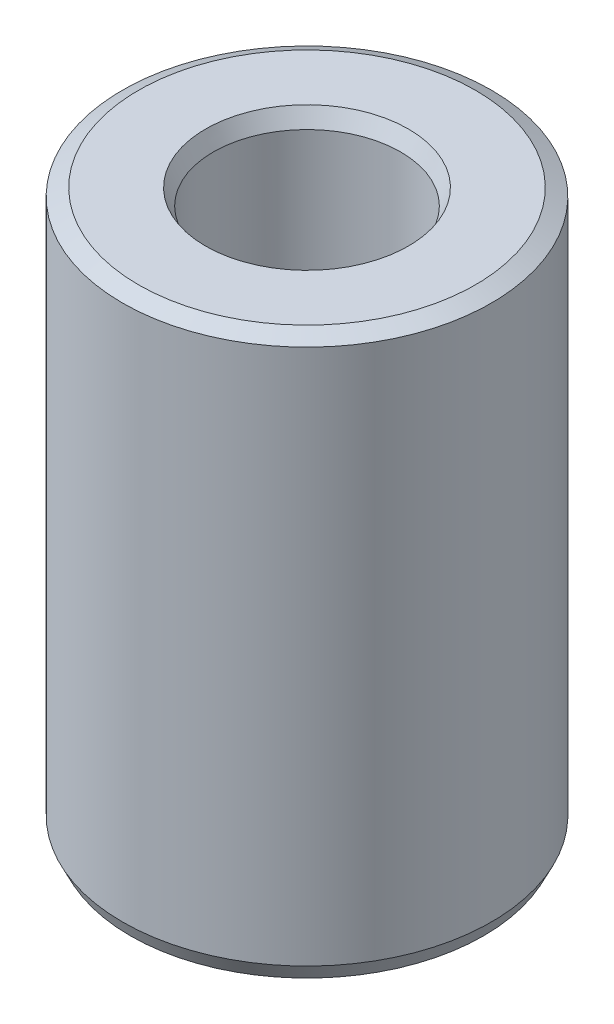
ISO-10303-21;
HEADER;
FILE_DESCRIPTION(('STEP AP214'),'2;1');
FILE_NAME('part.step','',(''),(''),'','','');
FILE_SCHEMA(('AUTOMOTIVE_DESIGN { 1 0 10303 214 1 1 1 1 }'));
ENDSEC;
DATA;
#1=APPLICATION_CONTEXT('core data for automotive mechanical design processes');
#2=APPLICATION_PROTOCOL_DEFINITION('international standard','automotive_design',2000,#1);
#3=PRODUCT_CONTEXT('',#1,'mechanical');
#4=PRODUCT('Part','Part','',(#3));
#5=PRODUCT_RELATED_PRODUCT_CATEGORY('part','',(#4));
#6=PRODUCT_DEFINITION_FORMATION('','',#4);
#7=PRODUCT_DEFINITION_CONTEXT('part definition',#1,'design');
#8=PRODUCT_DEFINITION('design','',#6,#7);
#9=PRODUCT_DEFINITION_SHAPE('','',#8);
#10=(LENGTH_UNIT() NAMED_UNIT(*) SI_UNIT(.MILLI.,.METRE.));
#11=(NAMED_UNIT(*) PLANE_ANGLE_UNIT() SI_UNIT($,.RADIAN.));
#12=(NAMED_UNIT(*) SI_UNIT($,.STERADIAN.) SOLID_ANGLE_UNIT());
#13=UNCERTAINTY_MEASURE_WITH_UNIT(LENGTH_MEASURE(1.E-05),#10,'distance_accuracy_value','');
#14=(GEOMETRIC_REPRESENTATION_CONTEXT(3) GLOBAL_UNCERTAINTY_ASSIGNED_CONTEXT((#13)) GLOBAL_UNIT_ASSIGNED_CONTEXT((#10,
#11,#12)) REPRESENTATION_CONTEXT('',''));
#15=CARTESIAN_POINT('',(0.,0.,0.));
#16=DIRECTION('',(0.,0.,1.));
#17=DIRECTION('',(1.,0.,0.));
#18=AXIS2_PLACEMENT_3D('',#15,#16,#17);
#19=CARTESIAN_POINT('',(0.,75.8702042213604,0.));
#20=DIRECTION('',(0.,-1.,0.));
#21=DIRECTION('',(0.,0.,-1.));
#22=AXIS2_PLACEMENT_3D('',#19,#20,#21);
#23=CYLINDRICAL_SURFACE('',#22,25.);
#24=CARTESIAN_POINT('',(0.,2.16007570095776,0.));
#25=DIRECTION('',(0.,1.,0.));
#26=DIRECTION('',(0.,0.,1.));
#27=AXIS2_PLACEMENT_3D('',#24,#25,#26);
#28=CIRCLE('',#27,25.);
#29=CARTESIAN_POINT('',(0.,2.16007570095775,-25.));
#30=VERTEX_POINT('',#29);
#31=EDGE_CURVE('E10',#30,#30,#28,.T.);
#32=CARTESIAN_POINT('',(0.,74.8098274000161,0.));
#33=DIRECTION('',(0.,1.,0.));
#34=DIRECTION('',(0.,0.,1.));
#35=AXIS2_PLACEMENT_3D('',#32,#33,#34);
#36=CIRCLE('',#35,25.);
#37=CARTESIAN_POINT('',(0.,74.8098274000161,-25.));
#38=VERTEX_POINT('',#37);
#39=EDGE_CURVE('E50',#38,#38,#36,.F.);
#40=CARTESIAN_POINT('',(0.,2.16007570095775,-25.));
#41=CARTESIAN_POINT('',(0.,2.91684394782294,-25.));
#42=CARTESIAN_POINT('',(0.,3.67361219468813,-25.));
#43=CARTESIAN_POINT('',(0.,5.18714868841851,-25.));
#44=CARTESIAN_POINT('',(0.,5.9439169352837,-25.));
#45=CARTESIAN_POINT('',(0.,7.45745342901408,-25.));
#46=CARTESIAN_POINT('',(0.,8.21422167587927,-25.));
#47=CARTESIAN_POINT('',(0.,9.72775816960965,-25.));
#48=CARTESIAN_POINT('',(0.,10.4845264164748,-25.));
#49=CARTESIAN_POINT('',(0.,11.9980629102052,-25.));
#50=CARTESIAN_POINT('',(0.,12.7548311570704,-25.));
#51=CARTESIAN_POINT('',(0.,14.2683676508008,-25.));
#52=CARTESIAN_POINT('',(0.,15.025135897666,-25.));
#53=CARTESIAN_POINT('',(0.,16.5386723913964,-25.));
#54=CARTESIAN_POINT('',(0.,17.2954406382616,-25.));
#55=CARTESIAN_POINT('',(0.,18.8089771319919,-25.));
#56=CARTESIAN_POINT('',(0.,19.5657453788571,-25.));
#57=CARTESIAN_POINT('',(0.,21.0792818725875,-25.));
#58=CARTESIAN_POINT('',(0.,21.8360501194527,-25.));
#59=CARTESIAN_POINT('',(0.,23.3495866131831,-25.));
#60=CARTESIAN_POINT('',(0.,24.1063548600483,-25.));
#61=CARTESIAN_POINT('',(0.,25.6198913537787,-25.));
#62=CARTESIAN_POINT('',(0.,26.3766596006439,-25.));
#63=CARTESIAN_POINT('',(0.,27.8901960943742,-25.));
#64=CARTESIAN_POINT('',(0.,28.6469643412394,-25.));
#65=CARTESIAN_POINT('',(0.,30.1605008349698,-25.));
#66=CARTESIAN_POINT('',(0.,30.917269081835,-25.));
#67=CARTESIAN_POINT('',(0.,32.4308055755654,-25.));
#68=CARTESIAN_POINT('',(0.,33.1875738224306,-25.));
#69=CARTESIAN_POINT('',(0.,34.701110316161,-25.));
#70=CARTESIAN_POINT('',(0.,35.4578785630261,-25.));
#71=CARTESIAN_POINT('',(0.,36.9714150567565,-25.));
#72=CARTESIAN_POINT('',(0.,37.7281833036217,-25.));
#73=CARTESIAN_POINT('',(0.,39.2417197973521,-25.));
#74=CARTESIAN_POINT('',(0.,39.9984880442173,-25.));
#75=CARTESIAN_POINT('',(0.,41.5120245379477,-25.));
#76=CARTESIAN_POINT('',(0.,42.2687927848129,-25.));
#77=CARTESIAN_POINT('',(0.,43.7823292785433,-25.));
#78=CARTESIAN_POINT('',(0.,44.5390975254084,-25.));
#79=CARTESIAN_POINT('',(0.,46.0526340191388,-25.));
#80=CARTESIAN_POINT('',(0.,46.809402266004,-25.));
#81=CARTESIAN_POINT('',(0.,48.3229387597344,-25.));
#82=CARTESIAN_POINT('',(0.,49.0797070065996,-25.));
#83=CARTESIAN_POINT('',(0.,50.59324350033,-25.));
#84=CARTESIAN_POINT('',(0.,51.3500117471952,-25.));
#85=CARTESIAN_POINT('',(0.,52.8635482409255,-25.));
#86=CARTESIAN_POINT('',(0.,53.6203164877907,-25.));
#87=CARTESIAN_POINT('',(0.,55.1338529815211,-25.));
#88=CARTESIAN_POINT('',(0.,55.8906212283863,-25.));
#89=CARTESIAN_POINT('',(0.,57.4041577221167,-25.));
#90=CARTESIAN_POINT('',(0.,58.1609259689819,-25.));
#91=CARTESIAN_POINT('',(0.,59.6744624627123,-25.));
#92=CARTESIAN_POINT('',(0.,60.4312307095774,-25.));
#93=CARTESIAN_POINT('',(0.,61.9447672033078,-25.));
#94=CARTESIAN_POINT('',(0.,62.701535450173,-25.));
#95=CARTESIAN_POINT('',(0.,64.2150719439034,-25.));
#96=CARTESIAN_POINT('',(0.,64.9718401907686,-25.));
#97=CARTESIAN_POINT('',(0.,66.485376684499,-25.));
#98=CARTESIAN_POINT('',(0.,67.2421449313642,-25.));
#99=CARTESIAN_POINT('',(0.,68.7556814250946,-25.));
#100=CARTESIAN_POINT('',(0.,69.5124496719598,-25.));
#101=CARTESIAN_POINT('',(0.,71.0259861656901,-25.));
#102=CARTESIAN_POINT('',(0.,71.7827544125553,-25.));
#103=CARTESIAN_POINT('',(0.,73.2962909062857,-25.));
#104=CARTESIAN_POINT('',(0.,74.0530591531509,-25.));
#105=CARTESIAN_POINT('',(0.,74.8098274000161,-25.));
#106=B_SPLINE_CURVE_WITH_KNOTS('',3,(#40,#41,#42,#43,#44,#45,#46,#47,#48,#49,#50,#51,#52,#53,
#54,#55,#56,#57,#58,#59,#60,#61,#62,#63,#64,#65,#66,#67,#68,#69,#70,#71,#72,#73,#74,#75,#76,#77,
#78,#79,#80,#81,#82,#83,#84,#85,#86,#87,#88,#89,#90,#91,#92,#93,#94,#95,#96,#97,#98,#99,#100,
#101,#102,#103,#104,#105),.UNSPECIFIED.,.F.,.F.,(4,2,2,2,2,2,2,2,2,2,2,2,2,2,2,2,2,2,2,2,2,2,2,
2,2,2,2,2,2,2,2,2,4),(0.,2.27030474059557,4.54060948119114,6.81091422178672,9.08121896238229,
11.3515237029779,13.6218284435734,15.892133184169,18.1624379247646,20.4327426653602,
22.7030474059557,24.9733521465513,27.2436568871469,29.5139616277424,31.784266368338,
34.0545711089336,36.3248758495292,38.5951805901247,40.8654853307203,43.1357900713159,
45.4060948119115,47.676399552507,49.9467042931026,52.2170090336982,54.4873137742938,
56.7576185148893,59.0279232554849,61.2982279960805,63.568532736676,65.8388374772716,
68.1091422178672,70.3794469584628,72.6497516990583),.UNSPECIFIED.);
#107=EDGE_CURVE('BSEAM39',#30,#38,#106,.T.);
#108=ORIENTED_EDGE('',*,*,#31,.T.);
#109=ORIENTED_EDGE('',*,*,#39,.T.);
#110=ORIENTED_EDGE('',*,*,#107,.T.);
#111=ORIENTED_EDGE('',*,*,#107,.F.);
#112=EDGE_LOOP('',(#108,#110,#109,#111));
#113=FACE_BOUND('',#112,.T.);
#114=ADVANCED_FACE('F39',(#113),#23,.T.);
#115=CARTESIAN_POINT('',(0.,75.8702042213604,0.));
#116=DIRECTION('',(0.,1.,0.));
#117=DIRECTION('',(0.,0.,1.));
#118=AXIS2_PLACEMENT_3D('',#115,#116,#117);
#119=PLANE('',#118);
#120=CARTESIAN_POINT('',(0.,75.8702042213604,0.));
#121=DIRECTION('',(0.,1.,0.));
#122=DIRECTION('',(0.,0.,1.));
#123=AXIS2_PLACEMENT_3D('',#120,#121,#122);
#124=CIRCLE('',#123,13.7490943435613);
#125=CARTESIAN_POINT('',(0.,75.8702042213604,13.7490943435613));
#126=VERTEX_POINT('',#125);
#127=EDGE_CURVE('E58',#126,#126,#124,.F.);
#128=ORIENTED_EDGE('',*,*,#127,.T.);
#129=EDGE_LOOP('',(#128));
#130=FACE_BOUND('',#129,.T.);
#131=CARTESIAN_POINT('',(0.,75.8702042213604,0.));
#132=DIRECTION('',(0.,1.,0.));
#133=DIRECTION('',(0.,0.,1.));
#134=AXIS2_PLACEMENT_3D('',#131,#132,#133);
#135=CIRCLE('',#134,22.8399242990425);
#136=CARTESIAN_POINT('',(0.,75.8702042213604,22.8399242990425));
#137=VERTEX_POINT('',#136);
#138=EDGE_CURVE('E61',#137,#137,#135,.T.);
#139=ORIENTED_EDGE('',*,*,#138,.T.);
#140=EDGE_LOOP('',(#139));
#141=FACE_BOUND('',#140,.T.);
#142=ADVANCED_FACE('F88',(#130,#141),#119,.T.);
#143=CARTESIAN_POINT('',(0.,0.,0.));
#144=DIRECTION('',(0.,1.,0.));
#145=DIRECTION('',(0.,0.,1.));
#146=AXIS2_PLACEMENT_3D('',#143,#144,#145);
#147=PLANE('',#146);
#148=CARTESIAN_POINT('',(0.,0.,0.));
#149=DIRECTION('',(0.,1.,0.));
#150=DIRECTION('',(0.,0.,1.));
#151=AXIS2_PLACEMENT_3D('',#148,#149,#150);
#152=CIRCLE('',#151,14.8487932231744);
#153=CARTESIAN_POINT('',(0.,0.,14.8487932231744));
#154=VERTEX_POINT('',#153);
#155=EDGE_CURVE('E51',#154,#154,#152,.T.);
#156=ORIENTED_EDGE('',*,*,#155,.T.);
#157=EDGE_LOOP('',(#156));
#158=FACE_BOUND('',#157,.T.);
#159=CARTESIAN_POINT('',(0.,0.,0.));
#160=DIRECTION('',(0.,1.,0.));
#161=DIRECTION('',(0.,0.,1.));
#162=AXIS2_PLACEMENT_3D('',#159,#160,#161);
#163=CIRCLE('',#162,23.9396231786556);
#164=CARTESIAN_POINT('',(0.,0.,23.9396231786556));
#165=VERTEX_POINT('',#164);
#166=EDGE_CURVE('E54',#165,#165,#163,.F.);
#167=ORIENTED_EDGE('',*,*,#166,.T.);
#168=EDGE_LOOP('',(#167));
#169=FACE_BOUND('',#168,.T.);
#170=ADVANCED_FACE('F83',(#158,#169),#147,.F.);
#171=CARTESIAN_POINT('',(0.,75.8702042213604,0.));
#172=DIRECTION('',(0.,-1.,0.));
#173=DIRECTION('',(0.,0.,-1.));
#174=AXIS2_PLACEMENT_3D('',#171,#172,#173);
#175=CYLINDRICAL_SURFACE('',#174,12.6887175222169);
#176=CARTESIAN_POINT('',(0.,73.7101285204027,0.));
#177=DIRECTION('',(0.,1.,0.));
#178=DIRECTION('',(0.,0.,1.));
#179=AXIS2_PLACEMENT_3D('',#176,#177,#178);
#180=CIRCLE('',#179,12.6887175222169);
#181=CARTESIAN_POINT('',(0.,73.7101285204027,-12.6887175222169));
#182=VERTEX_POINT('',#181);
#183=EDGE_CURVE('E67',#182,#182,#180,.T.);
#184=CARTESIAN_POINT('',(0.,1.0603768213443,0.));
#185=DIRECTION('',(0.,1.,0.));
#186=DIRECTION('',(0.,0.,1.));
#187=AXIS2_PLACEMENT_3D('',#184,#185,#186);
#188=CIRCLE('',#187,12.6887175222169);
#189=CARTESIAN_POINT('',(0.,1.0603768213443,-12.6887175222169));
#190=VERTEX_POINT('',#189);
#191=EDGE_CURVE('E69',#190,#190,#188,.F.);
#192=CARTESIAN_POINT('',(0.,73.7101285204027,-12.6887175222169));
#193=CARTESIAN_POINT('',(0.,72.9533602735375,-12.6887175222169));
#194=CARTESIAN_POINT('',(0.,72.1965920266723,-12.6887175222169));
#195=CARTESIAN_POINT('',(0.,70.6830555329419,-12.6887175222169));
#196=CARTESIAN_POINT('',(0.,69.9262872860767,-12.6887175222169));
#197=CARTESIAN_POINT('',(0.,68.4127507923463,-12.6887175222169));
#198=CARTESIAN_POINT('',(0.,67.6559825454811,-12.6887175222169));
#199=CARTESIAN_POINT('',(0.,66.1424460517508,-12.6887175222169));
#200=CARTESIAN_POINT('',(0.,65.3856778048856,-12.6887175222169));
#201=CARTESIAN_POINT('',(0.,63.8721413111552,-12.6887175222169));
#202=CARTESIAN_POINT('',(0.,63.11537306429,-12.6887175222169));
#203=CARTESIAN_POINT('',(0.,61.6018365705596,-12.6887175222169));
#204=CARTESIAN_POINT('',(0.,60.8450683236944,-12.6887175222169));
#205=CARTESIAN_POINT('',(0.,59.331531829964,-12.6887175222169));
#206=CARTESIAN_POINT('',(0.,58.5747635830989,-12.6887175222169));
#207=CARTESIAN_POINT('',(0.,57.0612270893685,-12.6887175222169));
#208=CARTESIAN_POINT('',(0.,56.3044588425033,-12.6887175222169));
#209=CARTESIAN_POINT('',(0.,54.7909223487729,-12.6887175222169));
#210=CARTESIAN_POINT('',(0.,54.0341541019077,-12.6887175222169));
#211=CARTESIAN_POINT('',(0.,52.5206176081773,-12.6887175222169));
#212=CARTESIAN_POINT('',(0.,51.7638493613121,-12.6887175222169));
#213=CARTESIAN_POINT('',(0.,50.2503128675817,-12.6887175222169));
#214=CARTESIAN_POINT('',(0.,49.4935446207166,-12.6887175222169));
#215=CARTESIAN_POINT('',(0.,47.9800081269862,-12.6887175222169));
#216=CARTESIAN_POINT('',(0.,47.223239880121,-12.6887175222169));
#217=CARTESIAN_POINT('',(0.,45.7097033863906,-12.6887175222169));
#218=CARTESIAN_POINT('',(0.,44.9529351395254,-12.6887175222169));
#219=CARTESIAN_POINT('',(0.,43.439398645795,-12.6887175222169));
#220=CARTESIAN_POINT('',(0.,42.6826303989298,-12.6887175222169));
#221=CARTESIAN_POINT('',(0.,41.1690939051994,-12.6887175222169));
#222=CARTESIAN_POINT('',(0.,40.4123256583343,-12.6887175222169));
#223=CARTESIAN_POINT('',(0.,38.8987891646039,-12.6887175222169));
#224=CARTESIAN_POINT('',(0.,38.1420209177387,-12.6887175222169));
#225=CARTESIAN_POINT('',(0.,36.6284844240083,-12.6887175222169));
#226=CARTESIAN_POINT('',(0.,35.8717161771431,-12.6887175222169));
#227=CARTESIAN_POINT('',(0.,34.3581796834127,-12.6887175222169));
#228=CARTESIAN_POINT('',(0.,33.6014114365475,-12.6887175222169));
#229=CARTESIAN_POINT('',(0.,32.0878749428171,-12.6887175222169));
#230=CARTESIAN_POINT('',(0.,31.331106695952,-12.6887175222169));
#231=CARTESIAN_POINT('',(0.,29.8175702022216,-12.6887175222169));
#232=CARTESIAN_POINT('',(0.,29.0608019553564,-12.6887175222169));
#233=CARTESIAN_POINT('',(0.,27.547265461626,-12.6887175222169));
#234=CARTESIAN_POINT('',(0.,26.7904972147608,-12.6887175222169));
#235=CARTESIAN_POINT('',(0.,25.2769607210304,-12.6887175222169));
#236=CARTESIAN_POINT('',(0.,24.5201924741652,-12.6887175222169));
#237=CARTESIAN_POINT('',(0.,23.0066559804349,-12.6887175222169));
#238=CARTESIAN_POINT('',(0.,22.2498877335697,-12.6887175222169));
#239=CARTESIAN_POINT('',(0.,20.7363512398393,-12.6887175222169));
#240=CARTESIAN_POINT('',(0.,19.9795829929741,-12.6887175222169));
#241=CARTESIAN_POINT('',(0.,18.4660464992437,-12.6887175222169));
#242=CARTESIAN_POINT('',(0.,17.7092782523785,-12.6887175222169));
#243=CARTESIAN_POINT('',(0.,16.1957417586481,-12.6887175222169));
#244=CARTESIAN_POINT('',(0.,15.4389735117829,-12.6887175222169));
#245=CARTESIAN_POINT('',(0.,13.9254370180526,-12.6887175222169));
#246=CARTESIAN_POINT('',(0.,13.1686687711874,-12.6887175222169));
#247=CARTESIAN_POINT('',(0.,11.655132277457,-12.6887175222169));
#248=CARTESIAN_POINT('',(0.,10.8983640305918,-12.6887175222169));
#249=CARTESIAN_POINT('',(0.,9.38482753686141,-12.6887175222169));
#250=CARTESIAN_POINT('',(0.,8.62805928999622,-12.6887175222169));
#251=CARTESIAN_POINT('',(0.,7.11452279626583,-12.6887175222169));
#252=CARTESIAN_POINT('',(0.,6.35775454940064,-12.6887175222169));
#253=CARTESIAN_POINT('',(0.,4.84421805567025,-12.6887175222169));
#254=CARTESIAN_POINT('',(0.,4.08744980880506,-12.6887175222169));
#255=CARTESIAN_POINT('',(0.,2.57391331507468,-12.6887175222169));
#256=CARTESIAN_POINT('',(0.,1.81714506820949,-12.6887175222169));
#257=CARTESIAN_POINT('',(0.,1.0603768213443,-12.6887175222169));
#258=B_SPLINE_CURVE_WITH_KNOTS('',3,(#192,#193,#194,#195,#196,#197,#198,#199,#200,#201,#202,
#203,#204,#205,#206,#207,#208,#209,#210,#211,#212,#213,#214,#215,#216,#217,#218,#219,#220,#221,
#222,#223,#224,#225,#226,#227,#228,#229,#230,#231,#232,#233,#234,#235,#236,#237,#238,#239,#240,
#241,#242,#243,#244,#245,#246,#247,#248,#249,#250,#251,#252,#253,#254,#255,#256,#257),
.UNSPECIFIED.,.F.,.F.,(4,2,2,2,2,2,2,2,2,2,2,2,2,2,2,2,2,2,2,2,2,2,2,2,2,2,2,2,2,2,2,2,4),(0.,
2.27030474059557,4.54060948119114,6.81091422178672,9.08121896238229,11.3515237029779,
13.6218284435734,15.892133184169,18.1624379247646,20.4327426653602,22.7030474059557,
24.9733521465513,27.2436568871469,29.5139616277425,31.784266368338,34.0545711089336,
36.3248758495292,38.5951805901247,40.8654853307203,43.1357900713159,45.4060948119115,
47.676399552507,49.9467042931026,52.2170090336982,54.4873137742938,56.7576185148893,
59.0279232554849,61.2982279960805,63.5685327366761,65.8388374772716,68.1091422178672,
70.3794469584628,72.6497516990584),.UNSPECIFIED.);
#259=EDGE_CURVE('BSEAM71',#182,#190,#258,.T.);
#260=ORIENTED_EDGE('',*,*,#183,.T.);
#261=ORIENTED_EDGE('',*,*,#191,.T.);
#262=ORIENTED_EDGE('',*,*,#259,.T.);
#263=ORIENTED_EDGE('',*,*,#259,.F.);
#264=EDGE_LOOP('',(#260,#262,#261,#263));
#265=FACE_BOUND('',#264,.T.);
#266=ADVANCED_FACE('F71',(#265),#175,.F.);
#267=CARTESIAN_POINT('',(0.,73.7101285204027,0.));
#268=DIRECTION('',(0.,1.,0.));
#269=DIRECTION('',(0.,0.,1.));
#270=AXIS2_PLACEMENT_3D('',#267,#268,#269);
#271=CONICAL_SURFACE('',#270,12.6887175222169,0.456339523884264);
#272=ORIENTED_EDGE('',*,*,#127,.F.);
#273=EDGE_LOOP('',(#272));
#274=FACE_BOUND('',#273,.T.);
#275=ORIENTED_EDGE('',*,*,#183,.F.);
#276=EDGE_LOOP('',(#275));
#277=FACE_BOUND('',#276,.T.);
#278=ADVANCED_FACE('F77',(#274,#277),#271,.F.);
#279=CARTESIAN_POINT('',(0.,0.,0.));
#280=DIRECTION('',(0.,-1.,0.));
#281=DIRECTION('',(0.,0.,-1.));
#282=AXIS2_PLACEMENT_3D('',#279,#280,#281);
#283=CONICAL_SURFACE('',#282,14.8487932231744,1.11445680291063);
#284=ORIENTED_EDGE('',*,*,#191,.F.);
#285=EDGE_LOOP('',(#284));
#286=FACE_BOUND('',#285,.T.);
#287=ORIENTED_EDGE('',*,*,#155,.F.);
#288=EDGE_LOOP('',(#287));
#289=FACE_BOUND('',#288,.T.);
#290=ADVANCED_FACE('F73',(#286,#289),#283,.F.);
#291=CARTESIAN_POINT('',(0.,2.16007570095776,0.));
#292=DIRECTION('',(0.,1.,0.));
#293=DIRECTION('',(0.,0.,1.));
#294=AXIS2_PLACEMENT_3D('',#291,#292,#293);
#295=CONICAL_SURFACE('',#294,25.,0.456339523884269);
#296=ORIENTED_EDGE('',*,*,#166,.F.);
#297=EDGE_LOOP('',(#296));
#298=FACE_BOUND('',#297,.T.);
#299=ORIENTED_EDGE('',*,*,#31,.F.);
#300=EDGE_LOOP('',(#299));
#301=FACE_BOUND('',#300,.T.);
#302=ADVANCED_FACE('F76',(#298,#301),#295,.T.);
#303=CARTESIAN_POINT('',(0.,75.8702042213604,0.));
#304=DIRECTION('',(0.,-1.,0.));
#305=DIRECTION('',(0.,0.,-1.));
#306=AXIS2_PLACEMENT_3D('',#303,#304,#305);
#307=CONICAL_SURFACE('',#306,22.8399242990425,1.11445680291063);
#308=ORIENTED_EDGE('',*,*,#39,.F.);
#309=EDGE_LOOP('',(#308));
#310=FACE_BOUND('',#309,.T.);
#311=ORIENTED_EDGE('',*,*,#138,.F.);
#312=EDGE_LOOP('',(#311));
#313=FACE_BOUND('',#312,.T.);
#314=ADVANCED_FACE('F45',(#310,#313),#307,.T.);
#315=CLOSED_SHELL('',(#114,#142,#170,#266,#278,#290,#302,#314));
#316=MANIFOLD_SOLID_BREP('B2',#315);
#317=ADVANCED_BREP_SHAPE_REPRESENTATION('',(#18,#316),#14);
#318=SHAPE_DEFINITION_REPRESENTATION(#9,#317);
ENDSEC;
END-ISO-10303-21;
